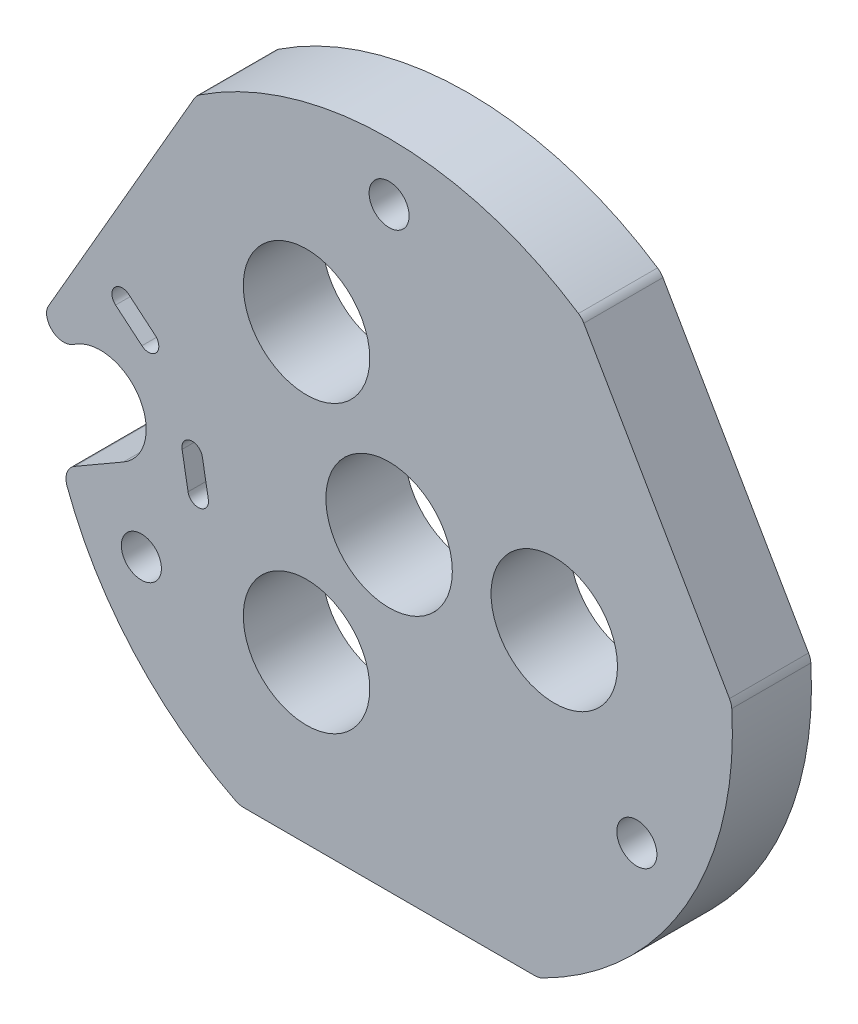
ISO-10303-21;
HEADER;
FILE_DESCRIPTION(('STEP AP214'),'2;1');
FILE_NAME('part.step','',(''),(''),'','','');
FILE_SCHEMA(('AUTOMOTIVE_DESIGN { 1 0 10303 214 1 1 1 1 }'));
ENDSEC;
DATA;
#1=APPLICATION_CONTEXT('core data for automotive mechanical design processes');
#2=APPLICATION_PROTOCOL_DEFINITION('international standard','automotive_design',2000,#1);
#3=PRODUCT_CONTEXT('',#1,'mechanical');
#4=PRODUCT('Part','Part','',(#3));
#5=PRODUCT_RELATED_PRODUCT_CATEGORY('part','',(#4));
#6=PRODUCT_DEFINITION_FORMATION('','',#4);
#7=PRODUCT_DEFINITION_CONTEXT('part definition',#1,'design');
#8=PRODUCT_DEFINITION('design','',#6,#7);
#9=PRODUCT_DEFINITION_SHAPE('','',#8);
#10=(LENGTH_UNIT() NAMED_UNIT(*) SI_UNIT(.MILLI.,.METRE.));
#11=(NAMED_UNIT(*) PLANE_ANGLE_UNIT() SI_UNIT($,.RADIAN.));
#12=(NAMED_UNIT(*) SI_UNIT($,.STERADIAN.) SOLID_ANGLE_UNIT());
#13=UNCERTAINTY_MEASURE_WITH_UNIT(LENGTH_MEASURE(1.E-05),#10,'distance_accuracy_value','');
#14=(GEOMETRIC_REPRESENTATION_CONTEXT(3) GLOBAL_UNCERTAINTY_ASSIGNED_CONTEXT((#13)) GLOBAL_UNIT_ASSIGNED_CONTEXT((#10,
#11,#12)) REPRESENTATION_CONTEXT('',''));
#15=CARTESIAN_POINT('',(0.,0.,0.));
#16=DIRECTION('',(0.,0.,1.));
#17=DIRECTION('',(1.,0.,0.));
#18=AXIS2_PLACEMENT_3D('',#15,#16,#17);
#19=CARTESIAN_POINT('',(13.7481980825256,36.7552666252305,6.91));
#20=DIRECTION('',(0.,0.,1.));
#21=DIRECTION('',(1.,0.,0.));
#22=AXIS2_PLACEMENT_3D('',#19,#20,#21);
#23=PLANE('',#22);
#24=DIRECTION('',(-0.173648177663373,0.984807753012835,0.));
#25=VECTOR('',#24,1.);
#26=CARTESIAN_POINT('',(24.6892351010403,41.4010013884279,6.91));
#27=LINE('',#26,#25);
#28=CARTESIAN_POINT('',(24.6892351010403,41.4010013884279,6.91));
#29=VERTEX_POINT('',#28);
#30=CARTESIAN_POINT('',(24.1682905680395,44.3554246475268,6.91));
#31=VERTEX_POINT('',#30);
#32=EDGE_CURVE('E238',#29,#31,#27,.T.);
#33=ORIENTED_EDGE('',*,*,#32,.F.);
#34=CARTESIAN_POINT('',(23.8029081233297,41.2447180285274,6.91));
#35=DIRECTION('',(0.,0.,1.));
#36=DIRECTION('',(1.,0.,0.));
#37=AXIS2_PLACEMENT_3D('',#34,#35,#36);
#38=CIRCLE('',#37,0.899999999999639);
#39=CARTESIAN_POINT('',(22.9165811456191,41.0884346686269,6.91));
#40=VERTEX_POINT('',#39);
#41=EDGE_CURVE('E236',#40,#29,#38,.T.);
#42=ORIENTED_EDGE('',*,*,#41,.F.);
#43=DIRECTION('',(0.173648177663518,-0.98480775301281,0.));
#44=VECTOR('',#43,1.);
#45=CARTESIAN_POINT('',(22.3956366126177,44.0428579277268,6.91));
#46=LINE('',#45,#44);
#47=CARTESIAN_POINT('',(22.3956366126177,44.0428579277268,6.91));
#48=VERTEX_POINT('',#47);
#49=EDGE_CURVE('E244',#48,#40,#46,.T.);
#50=ORIENTED_EDGE('',*,*,#49,.F.);
#51=CARTESIAN_POINT('',(23.2819635903286,44.199141287627,6.91));
#52=DIRECTION('',(0.,0.,1.));
#53=DIRECTION('',(1.,0.,0.));
#54=AXIS2_PLACEMENT_3D('',#51,#52,#53);
#55=CIRCLE('',#54,0.89999999999986);
#56=EDGE_CURVE('E241',#31,#48,#55,.T.);
#57=ORIENTED_EDGE('',*,*,#56,.F.);
#58=EDGE_LOOP('',(#33,#42,#50,#57));
#59=FACE_BOUND('',#58,.T.);
#60=CARTESIAN_POINT('',(62.1377695042287,34.1182927377275,6.91));
#61=DIRECTION('',(0.,0.,1.));
#62=DIRECTION('',(1.,0.,0.));
#63=AXIS2_PLACEMENT_3D('',#60,#61,#62);
#64=CIRCLE('',#63,1.7500000000004);
#65=CARTESIAN_POINT('',(63.8877695042291,34.1182927377275,6.91));
#66=VERTEX_POINT('',#65);
#67=EDGE_CURVE('E273',#66,#66,#64,.T.);
#68=ORIENTED_EDGE('',*,*,#67,.F.);
#69=EDGE_LOOP('',(#68));
#70=FACE_BOUND('',#69,.T.);
#71=CARTESIAN_POINT('',(40.4871344095733,46.6182927377691,6.91));
#72=DIRECTION('',(0.,0.,1.));
#73=DIRECTION('',(1.,0.,0.));
#74=AXIS2_PLACEMENT_3D('',#71,#72,#73);
#75=CIRCLE('',#74,5.52500000005475);
#76=CARTESIAN_POINT('',(46.012134409628,46.6182927377691,6.91));
#77=VERTEX_POINT('',#76);
#78=EDGE_CURVE('E285',#77,#77,#75,.T.);
#79=ORIENTED_EDGE('',*,*,#78,.F.);
#80=EDGE_LOOP('',(#79));
#81=FACE_BOUND('',#80,.T.);
#82=CARTESIAN_POINT('',(54.9208911393291,46.6182927377279,6.91));
#83=DIRECTION('',(0.,0.,1.));
#84=DIRECTION('',(1.,0.,0.));
#85=AXIS2_PLACEMENT_3D('',#82,#83,#84);
#86=CIRCLE('',#85,5.52499999999999);
#87=CARTESIAN_POINT('',(60.4458911393291,46.6182927377279,6.91));
#88=VERTEX_POINT('',#87);
#89=EDGE_CURVE('E297',#88,#88,#86,.T.);
#90=ORIENTED_EDGE('',*,*,#89,.F.);
#91=EDGE_LOOP('',(#90));
#92=FACE_BOUND('',#91,.T.);
#93=CARTESIAN_POINT('',(13.7481980825256,36.7552666252305,6.91));
#94=DIRECTION('',(0.,0.,1.));
#95=DIRECTION('',(1.,0.,0.));
#96=AXIS2_PLACEMENT_3D('',#93,#94,#95);
#97=CIRCLE('',#96,1.49999999998666);
#98=CARTESIAN_POINT('',(12.9981980825337,38.0543047308963,6.91));
#99=VERTEX_POINT('',#98);
#100=CARTESIAN_POINT('',(12.3408856442696,36.236159987737,6.91));
#101=VERTEX_POINT('',#100);
#102=EDGE_CURVE('E309',#99,#101,#97,.T.);
#103=ORIENTED_EDGE('',*,*,#102,.T.);
#104=CARTESIAN_POINT('',(40.4871344095733,46.6182927377691,6.91));
#105=DIRECTION('',(0.,0.,1.));
#106=DIRECTION('',(1.,0.,0.));
#107=AXIS2_PLACEMENT_3D('',#104,#105,#106);
#108=CIRCLE('',#107,29.9999999999608);
#109=CARTESIAN_POINT('',(27.0893217133919,19.7761874746626,6.91));
#110=VERTEX_POINT('',#109);
#111=EDGE_CURVE('E312',#101,#110,#108,.T.);
#112=ORIENTED_EDGE('',*,*,#111,.T.);
#113=CARTESIAN_POINT('',(27.7592123481972,21.1182927378128,6.91));
#114=DIRECTION('',(0.,0.,1.));
#115=DIRECTION('',(1.,0.,0.));
#116=AXIS2_PLACEMENT_3D('',#113,#114,#115);
#117=CIRCLE('',#116,1.49999999999177);
#118=CARTESIAN_POINT('',(27.7592123481996,19.618292737821,6.91));
#119=VERTEX_POINT('',#118);
#120=EDGE_CURVE('E315',#110,#119,#117,.T.);
#121=ORIENTED_EDGE('',*,*,#120,.T.);
#122=DIRECTION('',(1.,0.,0.));
#123=VECTOR('',#122,1.);
#124=CARTESIAN_POINT('',(27.7592123481996,19.618292737821,6.91));
#125=LINE('',#124,#123);
#126=CARTESIAN_POINT('',(53.2150564709992,19.618292737821,6.91));
#127=VERTEX_POINT('',#126);
#128=EDGE_CURVE('E317',#119,#127,#125,.T.);
#129=ORIENTED_EDGE('',*,*,#128,.T.);
#130=CARTESIAN_POINT('',(53.2150564710555,21.1182927378227,6.91));
#131=DIRECTION('',(0.,0.,1.));
#132=DIRECTION('',(1.,0.,0.));
#133=AXIS2_PLACEMENT_3D('',#130,#131,#132);
#134=CIRCLE('',#133,1.50000000000167);
#135=CARTESIAN_POINT('',(53.8849471057767,19.7761874746195,6.91));
#136=VERTEX_POINT('',#135);
#137=EDGE_CURVE('E319',#127,#136,#134,.T.);
#138=ORIENTED_EDGE('',*,*,#137,.T.);
#139=CARTESIAN_POINT('',(40.4871344095733,46.6182927377691,6.91));
#140=DIRECTION('',(0.,0.,1.));
#141=DIRECTION('',(1.,0.,0.));
#142=AXIS2_PLACEMENT_3D('',#139,#140,#141);
#143=CIRCLE('',#142,30.0000000000092);
#144=CARTESIAN_POINT('',(70.431985806616,48.4364992193272,6.91));
#145=VERTEX_POINT('',#144);
#146=EDGE_CURVE('E321',#136,#145,#143,.T.);
#147=ORIENTED_EDGE('',*,*,#146,.T.);
#148=CARTESIAN_POINT('',(68.93474323675,48.3455888952251,6.91));
#149=DIRECTION('',(0.,0.,1.));
#150=DIRECTION('',(1.,0.,0.));
#151=AXIS2_PLACEMENT_3D('',#148,#149,#150);
#152=CIRCLE('',#151,1.50000000001581);
#153=CARTESIAN_POINT('',(70.2337813424296,49.0955888952516,6.91));
#154=VERTEX_POINT('',#153);
#155=EDGE_CURVE('E323',#145,#154,#152,.T.);
#156=ORIENTED_EDGE('',*,*,#155,.T.);
#157=DIRECTION('',(-0.5,0.866025403784439,0.));
#158=VECTOR('',#157,1.);
#159=CARTESIAN_POINT('',(70.2337813424296,49.0955888952516,6.91));
#160=LINE('',#159,#158);
#161=CARTESIAN_POINT('',(57.5058592810823,71.1409965802819,6.91));
#162=VERTEX_POINT('',#161);
#163=EDGE_CURVE('E325',#154,#162,#160,.T.);
#164=ORIENTED_EDGE('',*,*,#163,.T.);
#165=CARTESIAN_POINT('',(56.2068211753933,70.3909965802341,6.91));
#166=DIRECTION('',(0.,0.,1.));
#167=DIRECTION('',(1.,0.,0.));
#168=AXIS2_PLACEMENT_3D('',#165,#166,#167);
#169=CIRCLE('',#168,1.50000000003459);
#170=CARTESIAN_POINT('',(57.0341731104273,71.642191519362,6.91));
#171=VERTEX_POINT('',#170);
#172=EDGE_CURVE('E327',#162,#171,#169,.T.);
#173=ORIENTED_EDGE('',*,*,#172,.T.);
#174=CARTESIAN_POINT('',(40.4871344095733,46.6182927377691,6.91));
#175=DIRECTION('',(0.,0.,1.));
#176=DIRECTION('',(1.,0.,0.));
#177=AXIS2_PLACEMENT_3D('',#174,#175,#176);
#178=CIRCLE('',#177,29.9999999999828);
#179=CARTESIAN_POINT('',(23.9400957087096,71.6421915193557,6.91));
#180=VERTEX_POINT('',#179);
#181=EDGE_CURVE('E329',#171,#180,#178,.T.);
#182=ORIENTED_EDGE('',*,*,#181,.T.);
#183=CARTESIAN_POINT('',(24.7674476438022,70.3909965803399,6.91));
#184=DIRECTION('',(0.,0.,1.));
#185=DIRECTION('',(1.,0.,0.));
#186=AXIS2_PLACEMENT_3D('',#183,#184,#185);
#187=CIRCLE('',#186,1.49999999997337);
#188=CARTESIAN_POINT('',(23.4684095381059,71.1409965802527,6.91));
#189=VERTEX_POINT('',#188);
#190=EDGE_CURVE('E331',#180,#189,#187,.T.);
#191=ORIENTED_EDGE('',*,*,#190,.T.);
#192=DIRECTION('',(-0.5,-0.866025403784439,0.));
#193=VECTOR('',#192,1.);
#194=CARTESIAN_POINT('',(23.4684095381059,71.1409965802527,6.91));
#195=LINE('',#194,#193);
#196=CARTESIAN_POINT('',(10.7322584968511,49.081335883928,6.91));
#197=VERTEX_POINT('',#196);
#198=EDGE_CURVE('E333',#189,#197,#195,.T.);
#199=ORIENTED_EDGE('',*,*,#198,.T.);
#200=CARTESIAN_POINT('',(12.031296602527,48.3313358839265,6.91));
#201=DIRECTION('',(0.,0.,1.));
#202=DIRECTION('',(1.,0.,0.));
#203=AXIS2_PLACEMENT_3D('',#200,#201,#202);
#204=CIRCLE('',#203,1.50000000000009);
#205=CARTESIAN_POINT('',(10.550877954664,48.5729153264709,6.91));
#206=VERTEX_POINT('',#205);
#207=EDGE_CURVE('E335',#197,#206,#204,.T.);
#208=ORIENTED_EDGE('',*,*,#207,.T.);
#209=CARTESIAN_POINT('',(12.0476907774209,48.4751841970356,6.91));
#210=DIRECTION('',(0.,0.,1.));
#211=DIRECTION('',(1.,0.,0.));
#212=AXIS2_PLACEMENT_3D('',#209,#210,#211);
#213=CIRCLE('',#212,1.50000000001005);
#214=CARTESIAN_POINT('',(12.7976907774277,47.1761460913513,6.91));
#215=VERTEX_POINT('',#214);
#216=EDGE_CURVE('E337',#206,#215,#213,.T.);
#217=ORIENTED_EDGE('',*,*,#216,.T.);
#218=DIRECTION('',(0.86602540378444,0.499999999999998,0.));
#219=VECTOR('',#218,1.);
#220=CARTESIAN_POINT('',(12.7976907774277,47.1761460913513,6.91));
#221=LINE('',#220,#219);
#222=CARTESIAN_POINT('',(13.2606834363141,47.4434550275921,6.91));
#223=VERTEX_POINT('',#222);
#224=EDGE_CURVE('E339',#215,#223,#221,.T.);
#225=ORIENTED_EDGE('',*,*,#224,.T.);
#226=CARTESIAN_POINT('',(15.2606834363134,43.9793534124548,6.91));
#227=DIRECTION('',(0.,0.,-1.));
#228=DIRECTION('',(1.,0.,0.));
#229=AXIS2_PLACEMENT_3D('',#226,#227,#228);
#230=CIRCLE('',#229,3.99999999999927);
#231=CARTESIAN_POINT('',(17.2606834363124,40.5152517973173,6.91));
#232=VERTEX_POINT('',#231);
#233=EDGE_CURVE('E341',#223,#232,#230,.T.);
#234=ORIENTED_EDGE('',*,*,#233,.T.);
#235=DIRECTION('',(-0.866025403784439,-0.5,0.));
#236=VECTOR('',#235,1.);
#237=CARTESIAN_POINT('',(17.2606834363124,40.5152517973173,6.91));
#238=LINE('',#237,#236);
#239=EDGE_CURVE('E343',#232,#99,#238,.T.);
#240=ORIENTED_EDGE('',*,*,#239,.T.);
#241=EDGE_LOOP('',(#103,#112,#121,#129,#138,#147,#156,#164,#173,#182,#191,#199,#208,#217,#225,
#234,#240));
#242=FACE_BOUND('',#241,.T.);
#243=CARTESIAN_POINT('',(33.2702560447294,34.1182927377288,6.91));
#244=DIRECTION('',(0.,0.,1.));
#245=DIRECTION('',(1.,0.,0.));
#246=AXIS2_PLACEMENT_3D('',#243,#244,#245);
#247=CIRCLE('',#246,5.52499999999935);
#248=CARTESIAN_POINT('',(38.7952560447287,34.1182927377288,6.91));
#249=VERTEX_POINT('',#248);
#250=EDGE_CURVE('E303',#249,#249,#247,.T.);
#251=ORIENTED_EDGE('',*,*,#250,.F.);
#252=EDGE_LOOP('',(#251));
#253=FACE_BOUND('',#252,.T.);
#254=CARTESIAN_POINT('',(33.2702560447282,59.1182927377278,6.91));
#255=DIRECTION('',(0.,0.,1.));
#256=DIRECTION('',(1.,0.,0.));
#257=AXIS2_PLACEMENT_3D('',#254,#255,#256);
#258=CIRCLE('',#257,5.52500000000052);
#259=CARTESIAN_POINT('',(38.7952560447287,59.1182927377278,6.91));
#260=VERTEX_POINT('',#259);
#261=EDGE_CURVE('E291',#260,#260,#258,.T.);
#262=ORIENTED_EDGE('',*,*,#261,.F.);
#263=EDGE_LOOP('',(#262));
#264=FACE_BOUND('',#263,.T.);
#265=CARTESIAN_POINT('',(18.8364993150286,34.1182927377272,6.91));
#266=DIRECTION('',(0.,0.,1.));
#267=DIRECTION('',(1.,0.,0.));
#268=AXIS2_PLACEMENT_3D('',#265,#266,#267);
#269=CIRCLE('',#268,1.75000000000018);
#270=CARTESIAN_POINT('',(20.5864993150288,34.1182927377272,6.91));
#271=VERTEX_POINT('',#270);
#272=EDGE_CURVE('E279',#271,#271,#269,.T.);
#273=ORIENTED_EDGE('',*,*,#272,.F.);
#274=EDGE_LOOP('',(#273));
#275=FACE_BOUND('',#274,.T.);
#276=CARTESIAN_POINT('',(40.4871344096287,71.6182927377274,6.91));
#277=DIRECTION('',(0.,0.,1.));
#278=DIRECTION('',(1.,0.,0.));
#279=AXIS2_PLACEMENT_3D('',#276,#277,#278);
#280=CIRCLE('',#279,1.74999999999961);
#281=CARTESIAN_POINT('',(42.2371344096283,71.6182927377274,6.91));
#282=VERTEX_POINT('',#281);
#283=EDGE_CURVE('E267',#282,#282,#280,.T.);
#284=ORIENTED_EDGE('',*,*,#283,.F.);
#285=EDGE_LOOP('',(#284));
#286=FACE_BOUND('',#285,.T.);
#287=DIRECTION('',(-0.766044443124658,0.64278760967977,0.));
#288=VECTOR('',#287,1.);
#289=CARTESIAN_POINT('',(20.040174245348,51.5055318580342,6.91));
#290=LINE('',#289,#288);
#291=CARTESIAN_POINT('',(20.040174245348,51.5055318580342,6.91));
#292=VERTEX_POINT('',#291);
#293=CARTESIAN_POINT('',(17.7420409160288,53.4338946870276,6.91));
#294=VERTEX_POINT('',#293);
#295=EDGE_CURVE('E208',#292,#294,#290,.T.);
#296=ORIENTED_EDGE('',*,*,#295,.F.);
#297=CARTESIAN_POINT('',(19.4616653966295,50.8160918592269,6.91));
#298=DIRECTION('',(0.,0.,1.));
#299=DIRECTION('',(1.,0.,0.));
#300=AXIS2_PLACEMENT_3D('',#297,#298,#299);
#301=CIRCLE('',#300,0.90000000000055);
#302=CARTESIAN_POINT('',(18.883156547911,50.1266518604197,6.91));
#303=VERTEX_POINT('',#302);
#304=EDGE_CURVE('E200',#303,#292,#301,.T.);
#305=ORIENTED_EDGE('',*,*,#304,.F.);
#306=DIRECTION('',(0.766044443130981,-0.642787609672235,0.));
#307=VECTOR('',#306,1.);
#308=CARTESIAN_POINT('',(16.5850232185286,52.0550146894275,6.91));
#309=LINE('',#308,#307);
#310=CARTESIAN_POINT('',(16.5850232185286,52.0550146894275,6.91));
#311=VERTEX_POINT('',#310);
#312=EDGE_CURVE('E222',#311,#303,#309,.T.);
#313=ORIENTED_EDGE('',*,*,#312,.F.);
#314=CARTESIAN_POINT('',(17.1635320672785,52.7444546882277,6.91));
#315=DIRECTION('',(0.,0.,1.));
#316=DIRECTION('',(1.,0.,0.));
#317=AXIS2_PLACEMENT_3D('',#314,#315,#316);
#318=CIRCLE('',#317,0.900000000015303);
#319=EDGE_CURVE('E220',#294,#311,#318,.T.);
#320=ORIENTED_EDGE('',*,*,#319,.F.);
#321=EDGE_LOOP('',(#296,#305,#313,#320));
#322=FACE_BOUND('',#321,.T.);
#323=ADVANCED_FACE('F33',(#59,#70,#81,#92,#242,#253,#264,#275,#286,#322),#23,.T.);
#324=CARTESIAN_POINT('',(13.7481980825256,36.7552666252305,0.));
#325=DIRECTION('',(0.,0.,1.));
#326=DIRECTION('',(1.,0.,0.));
#327=AXIS2_PLACEMENT_3D('',#324,#325,#326);
#328=PLANE('',#327);
#329=CARTESIAN_POINT('',(23.8029081233297,41.2447180285274,0.));
#330=DIRECTION('',(0.,0.,1.));
#331=DIRECTION('',(1.,0.,0.));
#332=AXIS2_PLACEMENT_3D('',#329,#330,#331);
#333=CIRCLE('',#332,0.899999999999639);
#334=CARTESIAN_POINT('',(22.9165811456191,41.0884346686269,0.));
#335=VERTEX_POINT('',#334);
#336=CARTESIAN_POINT('',(24.6892351010403,41.4010013884279,0.));
#337=VERTEX_POINT('',#336);
#338=EDGE_CURVE('E216',#335,#337,#333,.T.);
#339=ORIENTED_EDGE('',*,*,#338,.T.);
#340=DIRECTION('',(-0.173648177663373,0.984807753012835,0.));
#341=VECTOR('',#340,1.);
#342=CARTESIAN_POINT('',(24.6892351010403,41.4010013884279,0.));
#343=LINE('',#342,#341);
#344=CARTESIAN_POINT('',(24.1682905680395,44.3554246475268,0.));
#345=VERTEX_POINT('',#344);
#346=EDGE_CURVE('E249',#337,#345,#343,.T.);
#347=ORIENTED_EDGE('',*,*,#346,.T.);
#348=CARTESIAN_POINT('',(23.2819635903286,44.199141287627,0.));
#349=DIRECTION('',(0.,0.,1.));
#350=DIRECTION('',(1.,0.,0.));
#351=AXIS2_PLACEMENT_3D('',#348,#349,#350);
#352=CIRCLE('',#351,0.89999999999986);
#353=CARTESIAN_POINT('',(22.3956366126177,44.0428579277268,0.));
#354=VERTEX_POINT('',#353);
#355=EDGE_CURVE('E252',#345,#354,#352,.T.);
#356=ORIENTED_EDGE('',*,*,#355,.T.);
#357=DIRECTION('',(0.173648177663518,-0.98480775301281,0.));
#358=VECTOR('',#357,1.);
#359=CARTESIAN_POINT('',(22.3956366126177,44.0428579277268,0.));
#360=LINE('',#359,#358);
#361=EDGE_CURVE('E239',#354,#335,#360,.T.);
#362=ORIENTED_EDGE('',*,*,#361,.T.);
#363=EDGE_LOOP('',(#339,#347,#356,#362));
#364=FACE_BOUND('',#363,.T.);
#365=CARTESIAN_POINT('',(62.1377695042287,34.1182927377275,0.));
#366=DIRECTION('',(0.,0.,1.));
#367=DIRECTION('',(1.,0.,0.));
#368=AXIS2_PLACEMENT_3D('',#365,#366,#367);
#369=CIRCLE('',#368,1.7500000000004);
#370=CARTESIAN_POINT('',(63.8877695042291,34.1182927377275,0.));
#371=VERTEX_POINT('',#370);
#372=EDGE_CURVE('E270',#371,#371,#369,.T.);
#373=ORIENTED_EDGE('',*,*,#372,.T.);
#374=EDGE_LOOP('',(#373));
#375=FACE_BOUND('',#374,.T.);
#376=CARTESIAN_POINT('',(40.4871344095733,46.6182927377691,0.));
#377=DIRECTION('',(0.,0.,1.));
#378=DIRECTION('',(1.,0.,0.));
#379=AXIS2_PLACEMENT_3D('',#376,#377,#378);
#380=CIRCLE('',#379,5.52500000005475);
#381=CARTESIAN_POINT('',(46.012134409628,46.6182927377691,0.));
#382=VERTEX_POINT('',#381);
#383=EDGE_CURVE('E282',#382,#382,#380,.T.);
#384=ORIENTED_EDGE('',*,*,#383,.T.);
#385=EDGE_LOOP('',(#384));
#386=FACE_BOUND('',#385,.T.);
#387=CARTESIAN_POINT('',(54.9208911393291,46.6182927377279,0.));
#388=DIRECTION('',(0.,0.,1.));
#389=DIRECTION('',(1.,0.,0.));
#390=AXIS2_PLACEMENT_3D('',#387,#388,#389);
#391=CIRCLE('',#390,5.52499999999999);
#392=CARTESIAN_POINT('',(60.4458911393291,46.6182927377279,0.));
#393=VERTEX_POINT('',#392);
#394=EDGE_CURVE('E294',#393,#393,#391,.T.);
#395=ORIENTED_EDGE('',*,*,#394,.T.);
#396=EDGE_LOOP('',(#395));
#397=FACE_BOUND('',#396,.T.);
#398=CARTESIAN_POINT('',(13.7481980825256,36.7552666252305,0.));
#399=DIRECTION('',(0.,0.,1.));
#400=DIRECTION('',(1.,0.,0.));
#401=AXIS2_PLACEMENT_3D('',#398,#399,#400);
#402=CIRCLE('',#401,1.49999999998666);
#403=CARTESIAN_POINT('',(12.9981980825337,38.0543047308963,0.));
#404=VERTEX_POINT('',#403);
#405=CARTESIAN_POINT('',(12.3408856442696,36.236159987737,0.));
#406=VERTEX_POINT('',#405);
#407=EDGE_CURVE('E306',#404,#406,#402,.T.);
#408=ORIENTED_EDGE('',*,*,#407,.F.);
#409=DIRECTION('',(-0.866025403784439,-0.5,0.));
#410=VECTOR('',#409,1.);
#411=CARTESIAN_POINT('',(17.2606834363124,40.5152517973173,0.));
#412=LINE('',#411,#410);
#413=CARTESIAN_POINT('',(17.2606834363124,40.5152517973173,0.));
#414=VERTEX_POINT('',#413);
#415=EDGE_CURVE('E313',#414,#404,#412,.T.);
#416=ORIENTED_EDGE('',*,*,#415,.F.);
#417=CARTESIAN_POINT('',(15.2606834363134,43.9793534124548,0.));
#418=DIRECTION('',(0.,0.,-1.));
#419=DIRECTION('',(1.,0.,0.));
#420=AXIS2_PLACEMENT_3D('',#417,#418,#419);
#421=CIRCLE('',#420,3.99999999999927);
#422=CARTESIAN_POINT('',(13.2606834363141,47.4434550275921,0.));
#423=VERTEX_POINT('',#422);
#424=EDGE_CURVE('E376',#423,#414,#421,.T.);
#425=ORIENTED_EDGE('',*,*,#424,.F.);
#426=DIRECTION('',(0.86602540378444,0.499999999999998,0.));
#427=VECTOR('',#426,1.);
#428=CARTESIAN_POINT('',(12.7976907774277,47.1761460913513,0.));
#429=LINE('',#428,#427);
#430=CARTESIAN_POINT('',(12.7976907774277,47.1761460913513,0.));
#431=VERTEX_POINT('',#430);
#432=EDGE_CURVE('E374',#431,#423,#429,.T.);
#433=ORIENTED_EDGE('',*,*,#432,.F.);
#434=CARTESIAN_POINT('',(12.0476907774209,48.4751841970356,0.));
#435=DIRECTION('',(0.,0.,1.));
#436=DIRECTION('',(1.,0.,0.));
#437=AXIS2_PLACEMENT_3D('',#434,#435,#436);
#438=CIRCLE('',#437,1.50000000001005);
#439=CARTESIAN_POINT('',(10.550877954664,48.5729153264709,0.));
#440=VERTEX_POINT('',#439);
#441=EDGE_CURVE('E372',#440,#431,#438,.T.);
#442=ORIENTED_EDGE('',*,*,#441,.F.);
#443=CARTESIAN_POINT('',(12.031296602527,48.3313358839265,0.));
#444=DIRECTION('',(0.,0.,1.));
#445=DIRECTION('',(1.,0.,0.));
#446=AXIS2_PLACEMENT_3D('',#443,#444,#445);
#447=CIRCLE('',#446,1.50000000000009);
#448=CARTESIAN_POINT('',(10.7322584968511,49.081335883928,0.));
#449=VERTEX_POINT('',#448);
#450=EDGE_CURVE('E370',#449,#440,#447,.T.);
#451=ORIENTED_EDGE('',*,*,#450,.F.);
#452=DIRECTION('',(-0.5,-0.866025403784439,0.));
#453=VECTOR('',#452,1.);
#454=CARTESIAN_POINT('',(23.4684095381059,71.1409965802527,0.));
#455=LINE('',#454,#453);
#456=CARTESIAN_POINT('',(23.4684095381059,71.1409965802527,0.));
#457=VERTEX_POINT('',#456);
#458=EDGE_CURVE('E368',#457,#449,#455,.T.);
#459=ORIENTED_EDGE('',*,*,#458,.F.);
#460=CARTESIAN_POINT('',(24.7674476438022,70.3909965803399,0.));
#461=DIRECTION('',(0.,0.,1.));
#462=DIRECTION('',(1.,0.,0.));
#463=AXIS2_PLACEMENT_3D('',#460,#461,#462);
#464=CIRCLE('',#463,1.49999999997337);
#465=CARTESIAN_POINT('',(23.9400957087096,71.6421915193557,0.));
#466=VERTEX_POINT('',#465);
#467=EDGE_CURVE('E366',#466,#457,#464,.T.);
#468=ORIENTED_EDGE('',*,*,#467,.F.);
#469=CARTESIAN_POINT('',(40.4871344095733,46.6182927377691,0.));
#470=DIRECTION('',(0.,0.,1.));
#471=DIRECTION('',(1.,0.,0.));
#472=AXIS2_PLACEMENT_3D('',#469,#470,#471);
#473=CIRCLE('',#472,29.9999999999828);
#474=CARTESIAN_POINT('',(57.0341731104273,71.642191519362,0.));
#475=VERTEX_POINT('',#474);
#476=EDGE_CURVE('E364',#475,#466,#473,.T.);
#477=ORIENTED_EDGE('',*,*,#476,.F.);
#478=CARTESIAN_POINT('',(56.2068211753933,70.3909965802341,0.));
#479=DIRECTION('',(0.,0.,1.));
#480=DIRECTION('',(1.,0.,0.));
#481=AXIS2_PLACEMENT_3D('',#478,#479,#480);
#482=CIRCLE('',#481,1.50000000003459);
#483=CARTESIAN_POINT('',(57.5058592810823,71.1409965802819,0.));
#484=VERTEX_POINT('',#483);
#485=EDGE_CURVE('E362',#484,#475,#482,.T.);
#486=ORIENTED_EDGE('',*,*,#485,.F.);
#487=DIRECTION('',(-0.5,0.866025403784439,0.));
#488=VECTOR('',#487,1.);
#489=CARTESIAN_POINT('',(70.2337813424296,49.0955888952516,0.));
#490=LINE('',#489,#488);
#491=CARTESIAN_POINT('',(70.2337813424296,49.0955888952516,0.));
#492=VERTEX_POINT('',#491);
#493=EDGE_CURVE('E360',#492,#484,#490,.T.);
#494=ORIENTED_EDGE('',*,*,#493,.F.);
#495=CARTESIAN_POINT('',(68.93474323675,48.3455888952251,0.));
#496=DIRECTION('',(0.,0.,1.));
#497=DIRECTION('',(1.,0.,0.));
#498=AXIS2_PLACEMENT_3D('',#495,#496,#497);
#499=CIRCLE('',#498,1.50000000001581);
#500=CARTESIAN_POINT('',(70.431985806616,48.4364992193272,0.));
#501=VERTEX_POINT('',#500);
#502=EDGE_CURVE('E358',#501,#492,#499,.T.);
#503=ORIENTED_EDGE('',*,*,#502,.F.);
#504=CARTESIAN_POINT('',(40.4871344095733,46.6182927377691,0.));
#505=DIRECTION('',(0.,0.,1.));
#506=DIRECTION('',(1.,0.,0.));
#507=AXIS2_PLACEMENT_3D('',#504,#505,#506);
#508=CIRCLE('',#507,30.0000000000092);
#509=CARTESIAN_POINT('',(53.8849471057767,19.7761874746195,0.));
#510=VERTEX_POINT('',#509);
#511=EDGE_CURVE('E356',#510,#501,#508,.T.);
#512=ORIENTED_EDGE('',*,*,#511,.F.);
#513=CARTESIAN_POINT('',(53.2150564710555,21.1182927378227,0.));
#514=DIRECTION('',(0.,0.,1.));
#515=DIRECTION('',(1.,0.,0.));
#516=AXIS2_PLACEMENT_3D('',#513,#514,#515);
#517=CIRCLE('',#516,1.50000000000167);
#518=CARTESIAN_POINT('',(53.2150564709992,19.618292737821,0.));
#519=VERTEX_POINT('',#518);
#520=EDGE_CURVE('E354',#519,#510,#517,.T.);
#521=ORIENTED_EDGE('',*,*,#520,.F.);
#522=DIRECTION('',(1.,0.,0.));
#523=VECTOR('',#522,1.);
#524=CARTESIAN_POINT('',(27.7592123481996,19.618292737821,0.));
#525=LINE('',#524,#523);
#526=CARTESIAN_POINT('',(27.7592123481996,19.618292737821,0.));
#527=VERTEX_POINT('',#526);
#528=EDGE_CURVE('E352',#527,#519,#525,.T.);
#529=ORIENTED_EDGE('',*,*,#528,.F.);
#530=CARTESIAN_POINT('',(27.7592123481972,21.1182927378128,0.));
#531=DIRECTION('',(0.,0.,1.));
#532=DIRECTION('',(1.,0.,0.));
#533=AXIS2_PLACEMENT_3D('',#530,#531,#532);
#534=CIRCLE('',#533,1.49999999999177);
#535=CARTESIAN_POINT('',(27.0893217133919,19.7761874746626,0.));
#536=VERTEX_POINT('',#535);
#537=EDGE_CURVE('E350',#536,#527,#534,.T.);
#538=ORIENTED_EDGE('',*,*,#537,.F.);
#539=CARTESIAN_POINT('',(40.4871344095733,46.6182927377691,0.));
#540=DIRECTION('',(0.,0.,1.));
#541=DIRECTION('',(1.,0.,0.));
#542=AXIS2_PLACEMENT_3D('',#539,#540,#541);
#543=CIRCLE('',#542,29.9999999999608);
#544=EDGE_CURVE('E348',#406,#536,#543,.T.);
#545=ORIENTED_EDGE('',*,*,#544,.F.);
#546=EDGE_LOOP('',(#408,#416,#425,#433,#442,#451,#459,#468,#477,#486,#494,#503,#512,#521,#529,
#538,#545));
#547=FACE_BOUND('',#546,.T.);
#548=CARTESIAN_POINT('',(33.2702560447294,34.1182927377288,0.));
#549=DIRECTION('',(0.,0.,1.));
#550=DIRECTION('',(1.,0.,0.));
#551=AXIS2_PLACEMENT_3D('',#548,#549,#550);
#552=CIRCLE('',#551,5.52499999999935);
#553=CARTESIAN_POINT('',(38.7952560447287,34.1182927377288,0.));
#554=VERTEX_POINT('',#553);
#555=EDGE_CURVE('E300',#554,#554,#552,.T.);
#556=ORIENTED_EDGE('',*,*,#555,.T.);
#557=EDGE_LOOP('',(#556));
#558=FACE_BOUND('',#557,.T.);
#559=CARTESIAN_POINT('',(33.2702560447282,59.1182927377278,0.));
#560=DIRECTION('',(0.,0.,1.));
#561=DIRECTION('',(1.,0.,0.));
#562=AXIS2_PLACEMENT_3D('',#559,#560,#561);
#563=CIRCLE('',#562,5.52500000000052);
#564=CARTESIAN_POINT('',(38.7952560447287,59.1182927377278,0.));
#565=VERTEX_POINT('',#564);
#566=EDGE_CURVE('E288',#565,#565,#563,.T.);
#567=ORIENTED_EDGE('',*,*,#566,.T.);
#568=EDGE_LOOP('',(#567));
#569=FACE_BOUND('',#568,.T.);
#570=CARTESIAN_POINT('',(18.8364993150286,34.1182927377272,0.));
#571=DIRECTION('',(0.,0.,1.));
#572=DIRECTION('',(1.,0.,0.));
#573=AXIS2_PLACEMENT_3D('',#570,#571,#572);
#574=CIRCLE('',#573,1.75000000000018);
#575=CARTESIAN_POINT('',(20.5864993150288,34.1182927377272,0.));
#576=VERTEX_POINT('',#575);
#577=EDGE_CURVE('E276',#576,#576,#574,.T.);
#578=ORIENTED_EDGE('',*,*,#577,.T.);
#579=EDGE_LOOP('',(#578));
#580=FACE_BOUND('',#579,.T.);
#581=CARTESIAN_POINT('',(40.4871344096287,71.6182927377274,0.));
#582=DIRECTION('',(0.,0.,1.));
#583=DIRECTION('',(1.,0.,0.));
#584=AXIS2_PLACEMENT_3D('',#581,#582,#583);
#585=CIRCLE('',#584,1.74999999999961);
#586=CARTESIAN_POINT('',(42.2371344096283,71.6182927377274,0.));
#587=VERTEX_POINT('',#586);
#588=EDGE_CURVE('E266',#587,#587,#585,.T.);
#589=ORIENTED_EDGE('',*,*,#588,.T.);
#590=EDGE_LOOP('',(#589));
#591=FACE_BOUND('',#590,.T.);
#592=CARTESIAN_POINT('',(19.4616653966295,50.8160918592269,0.));
#593=DIRECTION('',(0.,0.,1.));
#594=DIRECTION('',(1.,0.,0.));
#595=AXIS2_PLACEMENT_3D('',#592,#593,#594);
#596=CIRCLE('',#595,0.90000000000055);
#597=CARTESIAN_POINT('',(18.883156547911,50.1266518604197,0.));
#598=VERTEX_POINT('',#597);
#599=CARTESIAN_POINT('',(20.040174245348,51.5055318580342,0.));
#600=VERTEX_POINT('',#599);
#601=EDGE_CURVE('E56',#598,#600,#596,.T.);
#602=ORIENTED_EDGE('',*,*,#601,.T.);
#603=DIRECTION('',(-0.766044443124658,0.64278760967977,0.));
#604=VECTOR('',#603,1.);
#605=CARTESIAN_POINT('',(20.040174245348,51.5055318580342,0.));
#606=LINE('',#605,#604);
#607=CARTESIAN_POINT('',(17.7420409160288,53.4338946870276,0.));
#608=VERTEX_POINT('',#607);
#609=EDGE_CURVE('E215',#600,#608,#606,.T.);
#610=ORIENTED_EDGE('',*,*,#609,.T.);
#611=CARTESIAN_POINT('',(17.1635320672785,52.7444546882277,0.));
#612=DIRECTION('',(0.,0.,1.));
#613=DIRECTION('',(1.,0.,0.));
#614=AXIS2_PLACEMENT_3D('',#611,#612,#613);
#615=CIRCLE('',#614,0.900000000015303);
#616=CARTESIAN_POINT('',(16.5850232185286,52.0550146894275,0.));
#617=VERTEX_POINT('',#616);
#618=EDGE_CURVE('E228',#608,#617,#615,.T.);
#619=ORIENTED_EDGE('',*,*,#618,.T.);
#620=DIRECTION('',(0.766044443130981,-0.642787609672235,0.));
#621=VECTOR('',#620,1.);
#622=CARTESIAN_POINT('',(16.5850232185286,52.0550146894275,0.));
#623=LINE('',#622,#621);
#624=EDGE_CURVE('E209',#617,#598,#623,.T.);
#625=ORIENTED_EDGE('',*,*,#624,.T.);
#626=EDGE_LOOP('',(#602,#610,#619,#625));
#627=FACE_BOUND('',#626,.T.);
#628=ADVANCED_FACE('F433',(#364,#375,#386,#397,#547,#558,#569,#580,#591,#627),#328,.F.);
#629=CARTESIAN_POINT('',(13.7481980825256,36.7552666252305,6.91));
#630=DIRECTION('',(0.,0.,-1.));
#631=DIRECTION('',(-1.,0.,0.));
#632=AXIS2_PLACEMENT_3D('',#629,#630,#631);
#633=CYLINDRICAL_SURFACE('',#632,1.49999999998666);
#634=ORIENTED_EDGE('',*,*,#407,.T.);
#635=DIRECTION('',(0.,0.,-1.));
#636=VECTOR('',#635,1.);
#637=CARTESIAN_POINT('',(12.3408856442696,36.236159987737,6.91));
#638=LINE('',#637,#636);
#639=EDGE_CURVE('E11',#101,#406,#638,.T.);
#640=ORIENTED_EDGE('',*,*,#639,.F.);
#641=ORIENTED_EDGE('',*,*,#102,.F.);
#642=DIRECTION('',(0.,0.,-1.));
#643=VECTOR('',#642,1.);
#644=CARTESIAN_POINT('',(12.9981980825337,38.0543047308963,6.91));
#645=LINE('',#644,#643);
#646=EDGE_CURVE('E345',#99,#404,#645,.T.);
#647=ORIENTED_EDGE('',*,*,#646,.T.);
#648=EDGE_LOOP('',(#634,#640,#641,#647));
#649=FACE_BOUND('',#648,.T.);
#650=ADVANCED_FACE('F35',(#649),#633,.T.);
#651=CARTESIAN_POINT('',(40.4871344095733,46.6182927377691,6.91));
#652=DIRECTION('',(0.,0.,-1.));
#653=DIRECTION('',(-1.,0.,0.));
#654=AXIS2_PLACEMENT_3D('',#651,#652,#653);
#655=CYLINDRICAL_SURFACE('',#654,29.9999999999608);
#656=ORIENTED_EDGE('',*,*,#544,.T.);
#657=DIRECTION('',(0.,0.,-1.));
#658=VECTOR('',#657,1.);
#659=CARTESIAN_POINT('',(27.0893217133919,19.7761874746626,6.91));
#660=LINE('',#659,#658);
#661=EDGE_CURVE('E41',#110,#536,#660,.T.);
#662=ORIENTED_EDGE('',*,*,#661,.F.);
#663=ORIENTED_EDGE('',*,*,#111,.F.);
#664=ORIENTED_EDGE('',*,*,#639,.T.);
#665=EDGE_LOOP('',(#656,#662,#663,#664));
#666=FACE_BOUND('',#665,.T.);
#667=ADVANCED_FACE('F451',(#666),#655,.T.);
#668=CARTESIAN_POINT('',(27.7592123481972,21.1182927378128,6.91));
#669=DIRECTION('',(0.,0.,-1.));
#670=DIRECTION('',(-1.,0.,0.));
#671=AXIS2_PLACEMENT_3D('',#668,#669,#670);
#672=CYLINDRICAL_SURFACE('',#671,1.49999999999177);
#673=ORIENTED_EDGE('',*,*,#537,.T.);
#674=DIRECTION('',(0.,0.,-1.));
#675=VECTOR('',#674,1.);
#676=CARTESIAN_POINT('',(27.7592123481996,19.618292737821,6.91));
#677=LINE('',#676,#675);
#678=EDGE_CURVE('E420',#119,#527,#677,.T.);
#679=ORIENTED_EDGE('',*,*,#678,.F.);
#680=ORIENTED_EDGE('',*,*,#120,.F.);
#681=ORIENTED_EDGE('',*,*,#661,.T.);
#682=EDGE_LOOP('',(#673,#679,#680,#681));
#683=FACE_BOUND('',#682,.T.);
#684=ADVANCED_FACE('F427',(#683),#672,.T.);
#685=CARTESIAN_POINT('',(27.7592123481996,19.618292737821,6.91));
#686=DIRECTION('',(0.,1.,0.));
#687=DIRECTION('',(0.,0.,1.));
#688=AXIS2_PLACEMENT_3D('',#685,#686,#687);
#689=PLANE('',#688);
#690=ORIENTED_EDGE('',*,*,#528,.T.);
#691=DIRECTION('',(0.,0.,-1.));
#692=VECTOR('',#691,1.);
#693=CARTESIAN_POINT('',(53.2150564709992,19.618292737821,6.91));
#694=LINE('',#693,#692);
#695=EDGE_CURVE('E417',#127,#519,#694,.T.);
#696=ORIENTED_EDGE('',*,*,#695,.F.);
#697=ORIENTED_EDGE('',*,*,#128,.F.);
#698=ORIENTED_EDGE('',*,*,#678,.T.);
#699=EDGE_LOOP('',(#690,#696,#697,#698));
#700=FACE_BOUND('',#699,.T.);
#701=ADVANCED_FACE('F439',(#700),#689,.F.);
#702=CARTESIAN_POINT('',(53.2150564710555,21.1182927378227,6.91));
#703=DIRECTION('',(0.,0.,-1.));
#704=DIRECTION('',(-1.,0.,0.));
#705=AXIS2_PLACEMENT_3D('',#702,#703,#704);
#706=CYLINDRICAL_SURFACE('',#705,1.50000000000167);
#707=ORIENTED_EDGE('',*,*,#520,.T.);
#708=DIRECTION('',(0.,0.,-1.));
#709=VECTOR('',#708,1.);
#710=CARTESIAN_POINT('',(53.8849471057767,19.7761874746195,6.91));
#711=LINE('',#710,#709);
#712=EDGE_CURVE('E414',#136,#510,#711,.T.);
#713=ORIENTED_EDGE('',*,*,#712,.F.);
#714=ORIENTED_EDGE('',*,*,#137,.F.);
#715=ORIENTED_EDGE('',*,*,#695,.T.);
#716=EDGE_LOOP('',(#707,#713,#714,#715));
#717=FACE_BOUND('',#716,.T.);
#718=ADVANCED_FACE('F443',(#717),#706,.T.);
#719=CARTESIAN_POINT('',(40.4871344095733,46.6182927377691,6.91));
#720=DIRECTION('',(0.,0.,-1.));
#721=DIRECTION('',(-1.,0.,0.));
#722=AXIS2_PLACEMENT_3D('',#719,#720,#721);
#723=CYLINDRICAL_SURFACE('',#722,30.0000000000092);
#724=ORIENTED_EDGE('',*,*,#511,.T.);
#725=DIRECTION('',(0.,0.,-1.));
#726=VECTOR('',#725,1.);
#727=CARTESIAN_POINT('',(70.431985806616,48.4364992193272,6.91));
#728=LINE('',#727,#726);
#729=EDGE_CURVE('E411',#145,#501,#728,.T.);
#730=ORIENTED_EDGE('',*,*,#729,.F.);
#731=ORIENTED_EDGE('',*,*,#146,.F.);
#732=ORIENTED_EDGE('',*,*,#712,.T.);
#733=EDGE_LOOP('',(#724,#730,#731,#732));
#734=FACE_BOUND('',#733,.T.);
#735=ADVANCED_FACE('F509',(#734),#723,.T.);
#736=CARTESIAN_POINT('',(68.93474323675,48.3455888952251,6.91));
#737=DIRECTION('',(0.,0.,-1.));
#738=DIRECTION('',(-1.,0.,0.));
#739=AXIS2_PLACEMENT_3D('',#736,#737,#738);
#740=CYLINDRICAL_SURFACE('',#739,1.50000000001581);
#741=ORIENTED_EDGE('',*,*,#502,.T.);
#742=DIRECTION('',(0.,0.,-1.));
#743=VECTOR('',#742,1.);
#744=CARTESIAN_POINT('',(70.2337813424296,49.0955888952516,6.91));
#745=LINE('',#744,#743);
#746=EDGE_CURVE('E408',#154,#492,#745,.T.);
#747=ORIENTED_EDGE('',*,*,#746,.F.);
#748=ORIENTED_EDGE('',*,*,#155,.F.);
#749=ORIENTED_EDGE('',*,*,#729,.T.);
#750=EDGE_LOOP('',(#741,#747,#748,#749));
#751=FACE_BOUND('',#750,.T.);
#752=ADVANCED_FACE('F507',(#751),#740,.T.);
#753=CARTESIAN_POINT('',(70.2337813424296,49.0955888952516,6.91));
#754=DIRECTION('',(-0.866025403784439,-0.5,0.));
#755=DIRECTION('',(0.5,-0.866025403784439,0.));
#756=AXIS2_PLACEMENT_3D('',#753,#754,#755);
#757=PLANE('',#756);
#758=ORIENTED_EDGE('',*,*,#493,.T.);
#759=DIRECTION('',(0.,0.,-1.));
#760=VECTOR('',#759,1.);
#761=CARTESIAN_POINT('',(57.5058592810823,71.1409965802819,6.91));
#762=LINE('',#761,#760);
#763=EDGE_CURVE('E405',#162,#484,#762,.T.);
#764=ORIENTED_EDGE('',*,*,#763,.F.);
#765=ORIENTED_EDGE('',*,*,#163,.F.);
#766=ORIENTED_EDGE('',*,*,#746,.T.);
#767=EDGE_LOOP('',(#758,#764,#765,#766));
#768=FACE_BOUND('',#767,.T.);
#769=ADVANCED_FACE('F502',(#768),#757,.F.);
#770=CARTESIAN_POINT('',(56.2068211753933,70.3909965802341,6.91));
#771=DIRECTION('',(0.,0.,-1.));
#772=DIRECTION('',(-1.,0.,0.));
#773=AXIS2_PLACEMENT_3D('',#770,#771,#772);
#774=CYLINDRICAL_SURFACE('',#773,1.50000000003459);
#775=ORIENTED_EDGE('',*,*,#485,.T.);
#776=DIRECTION('',(0.,0.,-1.));
#777=VECTOR('',#776,1.);
#778=CARTESIAN_POINT('',(57.0341731104273,71.642191519362,6.91));
#779=LINE('',#778,#777);
#780=EDGE_CURVE('E402',#171,#475,#779,.T.);
#781=ORIENTED_EDGE('',*,*,#780,.F.);
#782=ORIENTED_EDGE('',*,*,#172,.F.);
#783=ORIENTED_EDGE('',*,*,#763,.T.);
#784=EDGE_LOOP('',(#775,#781,#782,#783));
#785=FACE_BOUND('',#784,.T.);
#786=ADVANCED_FACE('F497',(#785),#774,.T.);
#787=CARTESIAN_POINT('',(40.4871344095733,46.6182927377691,6.91));
#788=DIRECTION('',(0.,0.,-1.));
#789=DIRECTION('',(-1.,0.,0.));
#790=AXIS2_PLACEMENT_3D('',#787,#788,#789);
#791=CYLINDRICAL_SURFACE('',#790,29.9999999999828);
#792=ORIENTED_EDGE('',*,*,#476,.T.);
#793=DIRECTION('',(0.,0.,-1.));
#794=VECTOR('',#793,1.);
#795=CARTESIAN_POINT('',(23.9400957087096,71.6421915193557,6.91));
#796=LINE('',#795,#794);
#797=EDGE_CURVE('E399',#180,#466,#796,.T.);
#798=ORIENTED_EDGE('',*,*,#797,.F.);
#799=ORIENTED_EDGE('',*,*,#181,.F.);
#800=ORIENTED_EDGE('',*,*,#780,.T.);
#801=EDGE_LOOP('',(#792,#798,#799,#800));
#802=FACE_BOUND('',#801,.T.);
#803=ADVANCED_FACE('F493',(#802),#791,.T.);
#804=CARTESIAN_POINT('',(24.7674476438022,70.3909965803399,6.91));
#805=DIRECTION('',(0.,0.,-1.));
#806=DIRECTION('',(-1.,0.,0.));
#807=AXIS2_PLACEMENT_3D('',#804,#805,#806);
#808=CYLINDRICAL_SURFACE('',#807,1.49999999997337);
#809=ORIENTED_EDGE('',*,*,#467,.T.);
#810=DIRECTION('',(0.,0.,-1.));
#811=VECTOR('',#810,1.);
#812=CARTESIAN_POINT('',(23.4684095381059,71.1409965802527,6.91));
#813=LINE('',#812,#811);
#814=EDGE_CURVE('E396',#189,#457,#813,.T.);
#815=ORIENTED_EDGE('',*,*,#814,.F.);
#816=ORIENTED_EDGE('',*,*,#190,.F.);
#817=ORIENTED_EDGE('',*,*,#797,.T.);
#818=EDGE_LOOP('',(#809,#815,#816,#817));
#819=FACE_BOUND('',#818,.T.);
#820=ADVANCED_FACE('F488',(#819),#808,.T.);
#821=CARTESIAN_POINT('',(23.4684095381059,71.1409965802527,6.91));
#822=DIRECTION('',(0.866025403784439,-0.5,0.));
#823=DIRECTION('',(0.5,0.866025403784439,0.));
#824=AXIS2_PLACEMENT_3D('',#821,#822,#823);
#825=PLANE('',#824);
#826=ORIENTED_EDGE('',*,*,#458,.T.);
#827=DIRECTION('',(0.,0.,-1.));
#828=VECTOR('',#827,1.);
#829=CARTESIAN_POINT('',(10.7322584968511,49.081335883928,6.91));
#830=LINE('',#829,#828);
#831=EDGE_CURVE('E393',#197,#449,#830,.T.);
#832=ORIENTED_EDGE('',*,*,#831,.F.);
#833=ORIENTED_EDGE('',*,*,#198,.F.);
#834=ORIENTED_EDGE('',*,*,#814,.T.);
#835=EDGE_LOOP('',(#826,#832,#833,#834));
#836=FACE_BOUND('',#835,.T.);
#837=ADVANCED_FACE('F482',(#836),#825,.F.);
#838=CARTESIAN_POINT('',(12.031296602527,48.3313358839265,6.91));
#839=DIRECTION('',(0.,0.,-1.));
#840=DIRECTION('',(-1.,0.,0.));
#841=AXIS2_PLACEMENT_3D('',#838,#839,#840);
#842=CYLINDRICAL_SURFACE('',#841,1.50000000000009);
#843=ORIENTED_EDGE('',*,*,#450,.T.);
#844=DIRECTION('',(0.,0.,-1.));
#845=VECTOR('',#844,1.);
#846=CARTESIAN_POINT('',(10.550877954664,48.5729153264709,6.91));
#847=LINE('',#846,#845);
#848=EDGE_CURVE('E390',#206,#440,#847,.T.);
#849=ORIENTED_EDGE('',*,*,#848,.F.);
#850=ORIENTED_EDGE('',*,*,#207,.F.);
#851=ORIENTED_EDGE('',*,*,#831,.T.);
#852=EDGE_LOOP('',(#843,#849,#850,#851));
#853=FACE_BOUND('',#852,.T.);
#854=ADVANCED_FACE('F478',(#853),#842,.T.);
#855=CARTESIAN_POINT('',(12.0476907774209,48.4751841970356,6.91));
#856=DIRECTION('',(0.,0.,-1.));
#857=DIRECTION('',(-1.,0.,0.));
#858=AXIS2_PLACEMENT_3D('',#855,#856,#857);
#859=CYLINDRICAL_SURFACE('',#858,1.50000000001005);
#860=ORIENTED_EDGE('',*,*,#441,.T.);
#861=DIRECTION('',(0.,0.,-1.));
#862=VECTOR('',#861,1.);
#863=CARTESIAN_POINT('',(12.7976907774277,47.1761460913513,6.91));
#864=LINE('',#863,#862);
#865=EDGE_CURVE('E387',#215,#431,#864,.T.);
#866=ORIENTED_EDGE('',*,*,#865,.F.);
#867=ORIENTED_EDGE('',*,*,#216,.F.);
#868=ORIENTED_EDGE('',*,*,#848,.T.);
#869=EDGE_LOOP('',(#860,#866,#867,#868));
#870=FACE_BOUND('',#869,.T.);
#871=ADVANCED_FACE('F473',(#870),#859,.T.);
#872=CARTESIAN_POINT('',(12.7976907774277,47.1761460913513,6.91));
#873=DIRECTION('',(-0.499999999999998,0.86602540378444,0.));
#874=DIRECTION('',(-0.86602540378444,-0.499999999999998,0.));
#875=AXIS2_PLACEMENT_3D('',#872,#873,#874);
#876=PLANE('',#875);
#877=ORIENTED_EDGE('',*,*,#432,.T.);
#878=DIRECTION('',(0.,0.,-1.));
#879=VECTOR('',#878,1.);
#880=CARTESIAN_POINT('',(13.2606834363141,47.4434550275921,6.91));
#881=LINE('',#880,#879);
#882=EDGE_CURVE('E384',#223,#423,#881,.T.);
#883=ORIENTED_EDGE('',*,*,#882,.F.);
#884=ORIENTED_EDGE('',*,*,#224,.F.);
#885=ORIENTED_EDGE('',*,*,#865,.T.);
#886=EDGE_LOOP('',(#877,#883,#884,#885));
#887=FACE_BOUND('',#886,.T.);
#888=ADVANCED_FACE('F467',(#887),#876,.F.);
#889=CARTESIAN_POINT('',(15.2606834363134,43.9793534124548,6.91));
#890=DIRECTION('',(0.,0.,-1.));
#891=DIRECTION('',(-1.,0.,0.));
#892=AXIS2_PLACEMENT_3D('',#889,#890,#891);
#893=CYLINDRICAL_SURFACE('',#892,3.99999999999927);
#894=ORIENTED_EDGE('',*,*,#424,.T.);
#895=DIRECTION('',(0.,0.,-1.));
#896=VECTOR('',#895,1.);
#897=CARTESIAN_POINT('',(17.2606834363124,40.5152517973173,6.91));
#898=LINE('',#897,#896);
#899=EDGE_CURVE('E381',#232,#414,#898,.T.);
#900=ORIENTED_EDGE('',*,*,#899,.F.);
#901=ORIENTED_EDGE('',*,*,#233,.F.);
#902=ORIENTED_EDGE('',*,*,#882,.T.);
#903=EDGE_LOOP('',(#894,#900,#901,#902));
#904=FACE_BOUND('',#903,.T.);
#905=ADVANCED_FACE('F463',(#904),#893,.F.);
#906=CARTESIAN_POINT('',(17.2606834363124,40.5152517973173,6.91));
#907=DIRECTION('',(0.5,-0.866025403784439,0.));
#908=DIRECTION('',(0.866025403784439,0.5,0.));
#909=AXIS2_PLACEMENT_3D('',#906,#907,#908);
#910=PLANE('',#909);
#911=ORIENTED_EDGE('',*,*,#415,.T.);
#912=ORIENTED_EDGE('',*,*,#646,.F.);
#913=ORIENTED_EDGE('',*,*,#239,.F.);
#914=ORIENTED_EDGE('',*,*,#899,.T.);
#915=EDGE_LOOP('',(#911,#912,#913,#914));
#916=FACE_BOUND('',#915,.T.);
#917=ADVANCED_FACE('F458',(#916),#910,.F.);
#918=CARTESIAN_POINT('',(33.2702560447294,34.1182927377288,6.91));
#919=DIRECTION('',(0.,0.,-1.));
#920=DIRECTION('',(-1.,0.,0.));
#921=AXIS2_PLACEMENT_3D('',#918,#919,#920);
#922=CYLINDRICAL_SURFACE('',#921,5.52499999999935);
#923=ORIENTED_EDGE('',*,*,#250,.T.);
#924=EDGE_LOOP('',(#923));
#925=FACE_BOUND('',#924,.T.);
#926=ORIENTED_EDGE('',*,*,#555,.F.);
#927=EDGE_LOOP('',(#926));
#928=FACE_BOUND('',#927,.T.);
#929=ADVANCED_FACE('F529',(#925,#928),#922,.F.);
#930=CARTESIAN_POINT('',(54.9208911393291,46.6182927377279,6.91));
#931=DIRECTION('',(0.,0.,-1.));
#932=DIRECTION('',(-1.,0.,0.));
#933=AXIS2_PLACEMENT_3D('',#930,#931,#932);
#934=CYLINDRICAL_SURFACE('',#933,5.52499999999999);
#935=ORIENTED_EDGE('',*,*,#89,.T.);
#936=EDGE_LOOP('',(#935));
#937=FACE_BOUND('',#936,.T.);
#938=ORIENTED_EDGE('',*,*,#394,.F.);
#939=EDGE_LOOP('',(#938));
#940=FACE_BOUND('',#939,.T.);
#941=ADVANCED_FACE('F597',(#937,#940),#934,.F.);
#942=CARTESIAN_POINT('',(33.2702560447282,59.1182927377278,6.91));
#943=DIRECTION('',(0.,0.,-1.));
#944=DIRECTION('',(-1.,0.,0.));
#945=AXIS2_PLACEMENT_3D('',#942,#943,#944);
#946=CYLINDRICAL_SURFACE('',#945,5.52500000000052);
#947=ORIENTED_EDGE('',*,*,#261,.T.);
#948=EDGE_LOOP('',(#947));
#949=FACE_BOUND('',#948,.T.);
#950=ORIENTED_EDGE('',*,*,#566,.F.);
#951=EDGE_LOOP('',(#950));
#952=FACE_BOUND('',#951,.T.);
#953=ADVANCED_FACE('F604',(#949,#952),#946,.F.);
#954=CARTESIAN_POINT('',(40.4871344095733,46.6182927377691,6.91));
#955=DIRECTION('',(0.,0.,-1.));
#956=DIRECTION('',(-1.,0.,0.));
#957=AXIS2_PLACEMENT_3D('',#954,#955,#956);
#958=CYLINDRICAL_SURFACE('',#957,5.52500000005475);
#959=ORIENTED_EDGE('',*,*,#78,.T.);
#960=EDGE_LOOP('',(#959));
#961=FACE_BOUND('',#960,.T.);
#962=ORIENTED_EDGE('',*,*,#383,.F.);
#963=EDGE_LOOP('',(#962));
#964=FACE_BOUND('',#963,.T.);
#965=ADVANCED_FACE('F611',(#961,#964),#958,.F.);
#966=CARTESIAN_POINT('',(18.8364993150286,34.1182927377272,6.91));
#967=DIRECTION('',(0.,0.,-1.));
#968=DIRECTION('',(-1.,0.,0.));
#969=AXIS2_PLACEMENT_3D('',#966,#967,#968);
#970=CYLINDRICAL_SURFACE('',#969,1.75000000000018);
#971=ORIENTED_EDGE('',*,*,#272,.T.);
#972=EDGE_LOOP('',(#971));
#973=FACE_BOUND('',#972,.T.);
#974=ORIENTED_EDGE('',*,*,#577,.F.);
#975=EDGE_LOOP('',(#974));
#976=FACE_BOUND('',#975,.T.);
#977=ADVANCED_FACE('F619',(#973,#976),#970,.F.);
#978=CARTESIAN_POINT('',(62.1377695042287,34.1182927377275,6.91));
#979=DIRECTION('',(0.,0.,-1.));
#980=DIRECTION('',(-1.,0.,0.));
#981=AXIS2_PLACEMENT_3D('',#978,#979,#980);
#982=CYLINDRICAL_SURFACE('',#981,1.7500000000004);
#983=ORIENTED_EDGE('',*,*,#67,.T.);
#984=EDGE_LOOP('',(#983));
#985=FACE_BOUND('',#984,.T.);
#986=ORIENTED_EDGE('',*,*,#372,.F.);
#987=EDGE_LOOP('',(#986));
#988=FACE_BOUND('',#987,.T.);
#989=ADVANCED_FACE('F627',(#985,#988),#982,.F.);
#990=CARTESIAN_POINT('',(40.4871344096287,71.6182927377274,6.91));
#991=DIRECTION('',(0.,0.,-1.));
#992=DIRECTION('',(-1.,0.,0.));
#993=AXIS2_PLACEMENT_3D('',#990,#991,#992);
#994=CYLINDRICAL_SURFACE('',#993,1.74999999999961);
#995=ORIENTED_EDGE('',*,*,#283,.T.);
#996=EDGE_LOOP('',(#995));
#997=FACE_BOUND('',#996,.T.);
#998=ORIENTED_EDGE('',*,*,#588,.F.);
#999=EDGE_LOOP('',(#998));
#1000=FACE_BOUND('',#999,.T.);
#1001=ADVANCED_FACE('F635',(#997,#1000),#994,.F.);
#1002=CARTESIAN_POINT('',(23.8029081233297,41.2447180285274,6.91));
#1003=DIRECTION('',(0.,0.,-1.));
#1004=DIRECTION('',(-1.,0.,0.));
#1005=AXIS2_PLACEMENT_3D('',#1002,#1003,#1004);
#1006=CYLINDRICAL_SURFACE('',#1005,0.899999999999639);
#1007=ORIENTED_EDGE('',*,*,#338,.F.);
#1008=DIRECTION('',(0.,0.,-1.));
#1009=VECTOR('',#1008,1.);
#1010=CARTESIAN_POINT('',(22.9165811456191,41.0884346686269,6.91));
#1011=LINE('',#1010,#1009);
#1012=EDGE_CURVE('E246',#40,#335,#1011,.T.);
#1013=ORIENTED_EDGE('',*,*,#1012,.F.);
#1014=ORIENTED_EDGE('',*,*,#41,.T.);
#1015=DIRECTION('',(0.,0.,-1.));
#1016=VECTOR('',#1015,1.);
#1017=CARTESIAN_POINT('',(24.6892351010403,41.4010013884279,6.91));
#1018=LINE('',#1017,#1016);
#1019=EDGE_CURVE('E263',#29,#337,#1018,.T.);
#1020=ORIENTED_EDGE('',*,*,#1019,.T.);
#1021=EDGE_LOOP('',(#1007,#1013,#1014,#1020));
#1022=FACE_BOUND('',#1021,.T.);
#1023=ADVANCED_FACE('F643',(#1022),#1006,.F.);
#1024=CARTESIAN_POINT('',(24.6892351010403,41.4010013884279,6.91));
#1025=DIRECTION('',(-0.984807753012836,-0.173648177663373,0.));
#1026=DIRECTION('',(0.173648177663373,-0.984807753012836,0.));
#1027=AXIS2_PLACEMENT_3D('',#1024,#1025,#1026);
#1028=PLANE('',#1027);
#1029=ORIENTED_EDGE('',*,*,#346,.F.);
#1030=ORIENTED_EDGE('',*,*,#1019,.F.);
#1031=ORIENTED_EDGE('',*,*,#32,.T.);
#1032=DIRECTION('',(0.,0.,-1.));
#1033=VECTOR('',#1032,1.);
#1034=CARTESIAN_POINT('',(24.1682905680395,44.3554246475268,6.91));
#1035=LINE('',#1034,#1033);
#1036=EDGE_CURVE('E261',#31,#345,#1035,.T.);
#1037=ORIENTED_EDGE('',*,*,#1036,.T.);
#1038=EDGE_LOOP('',(#1029,#1030,#1031,#1037));
#1039=FACE_BOUND('',#1038,.T.);
#1040=ADVANCED_FACE('F651',(#1039),#1028,.T.);
#1041=CARTESIAN_POINT('',(23.2819635903286,44.199141287627,6.91));
#1042=DIRECTION('',(0.,0.,-1.));
#1043=DIRECTION('',(-1.,0.,0.));
#1044=AXIS2_PLACEMENT_3D('',#1041,#1042,#1043);
#1045=CYLINDRICAL_SURFACE('',#1044,0.89999999999986);
#1046=ORIENTED_EDGE('',*,*,#355,.F.);
#1047=ORIENTED_EDGE('',*,*,#1036,.F.);
#1048=ORIENTED_EDGE('',*,*,#56,.T.);
#1049=DIRECTION('',(0.,0.,-1.));
#1050=VECTOR('',#1049,1.);
#1051=CARTESIAN_POINT('',(22.3956366126177,44.0428579277268,6.91));
#1052=LINE('',#1051,#1050);
#1053=EDGE_CURVE('E259',#48,#354,#1052,.T.);
#1054=ORIENTED_EDGE('',*,*,#1053,.T.);
#1055=EDGE_LOOP('',(#1046,#1047,#1048,#1054));
#1056=FACE_BOUND('',#1055,.T.);
#1057=ADVANCED_FACE('F659',(#1056),#1045,.F.);
#1058=CARTESIAN_POINT('',(22.3956366126177,44.0428579277268,6.91));
#1059=DIRECTION('',(0.98480775301281,0.173648177663518,0.));
#1060=DIRECTION('',(-0.173648177663518,0.98480775301281,0.));
#1061=AXIS2_PLACEMENT_3D('',#1058,#1059,#1060);
#1062=PLANE('',#1061);
#1063=ORIENTED_EDGE('',*,*,#361,.F.);
#1064=ORIENTED_EDGE('',*,*,#1053,.F.);
#1065=ORIENTED_EDGE('',*,*,#49,.T.);
#1066=ORIENTED_EDGE('',*,*,#1012,.T.);
#1067=EDGE_LOOP('',(#1063,#1064,#1065,#1066));
#1068=FACE_BOUND('',#1067,.T.);
#1069=ADVANCED_FACE('F667',(#1068),#1062,.T.);
#1070=CARTESIAN_POINT('',(19.4616653966295,50.8160918592269,6.91));
#1071=DIRECTION('',(0.,0.,-1.));
#1072=DIRECTION('',(-1.,0.,0.));
#1073=AXIS2_PLACEMENT_3D('',#1070,#1071,#1072);
#1074=CYLINDRICAL_SURFACE('',#1073,0.90000000000055);
#1075=ORIENTED_EDGE('',*,*,#601,.F.);
#1076=DIRECTION('',(0.,0.,-1.));
#1077=VECTOR('',#1076,1.);
#1078=CARTESIAN_POINT('',(18.883156547911,50.1266518604197,6.91));
#1079=LINE('',#1078,#1077);
#1080=EDGE_CURVE('E204',#303,#598,#1079,.T.);
#1081=ORIENTED_EDGE('',*,*,#1080,.F.);
#1082=ORIENTED_EDGE('',*,*,#304,.T.);
#1083=DIRECTION('',(0.,0.,-1.));
#1084=VECTOR('',#1083,1.);
#1085=CARTESIAN_POINT('',(20.040174245348,51.5055318580342,6.91));
#1086=LINE('',#1085,#1084);
#1087=EDGE_CURVE('E203',#292,#600,#1086,.T.);
#1088=ORIENTED_EDGE('',*,*,#1087,.T.);
#1089=EDGE_LOOP('',(#1075,#1081,#1082,#1088));
#1090=FACE_BOUND('',#1089,.T.);
#1091=ADVANCED_FACE('F202',(#1090),#1074,.F.);
#1092=CARTESIAN_POINT('',(20.040174245348,51.5055318580342,6.91));
#1093=DIRECTION('',(-0.64278760967977,-0.766044443124658,0.));
#1094=DIRECTION('',(0.766044443124658,-0.64278760967977,0.));
#1095=AXIS2_PLACEMENT_3D('',#1092,#1093,#1094);
#1096=PLANE('',#1095);
#1097=ORIENTED_EDGE('',*,*,#609,.F.);
#1098=ORIENTED_EDGE('',*,*,#1087,.F.);
#1099=ORIENTED_EDGE('',*,*,#295,.T.);
#1100=DIRECTION('',(0.,0.,-1.));
#1101=VECTOR('',#1100,1.);
#1102=CARTESIAN_POINT('',(17.7420409160288,53.4338946870276,6.91));
#1103=LINE('',#1102,#1101);
#1104=EDGE_CURVE('E217',#294,#608,#1103,.T.);
#1105=ORIENTED_EDGE('',*,*,#1104,.T.);
#1106=EDGE_LOOP('',(#1097,#1098,#1099,#1105));
#1107=FACE_BOUND('',#1106,.T.);
#1108=ADVANCED_FACE('F212',(#1107),#1096,.T.);
#1109=CARTESIAN_POINT('',(17.1635320672785,52.7444546882277,6.91));
#1110=DIRECTION('',(0.,0.,-1.));
#1111=DIRECTION('',(-1.,0.,0.));
#1112=AXIS2_PLACEMENT_3D('',#1109,#1110,#1111);
#1113=CYLINDRICAL_SURFACE('',#1112,0.900000000015303);
#1114=ORIENTED_EDGE('',*,*,#618,.F.);
#1115=ORIENTED_EDGE('',*,*,#1104,.F.);
#1116=ORIENTED_EDGE('',*,*,#319,.T.);
#1117=DIRECTION('',(0.,0.,-1.));
#1118=VECTOR('',#1117,1.);
#1119=CARTESIAN_POINT('',(16.5850232185286,52.0550146894275,6.91));
#1120=LINE('',#1119,#1118);
#1121=EDGE_CURVE('E48',#311,#617,#1120,.T.);
#1122=ORIENTED_EDGE('',*,*,#1121,.T.);
#1123=EDGE_LOOP('',(#1114,#1115,#1116,#1122));
#1124=FACE_BOUND('',#1123,.T.);
#1125=ADVANCED_FACE('F688',(#1124),#1113,.F.);
#1126=CARTESIAN_POINT('',(16.5850232185286,52.0550146894275,6.91));
#1127=DIRECTION('',(0.642787609672235,0.766044443130981,0.));
#1128=DIRECTION('',(-0.766044443130981,0.642787609672235,0.));
#1129=AXIS2_PLACEMENT_3D('',#1126,#1127,#1128);
#1130=PLANE('',#1129);
#1131=ORIENTED_EDGE('',*,*,#624,.F.);
#1132=ORIENTED_EDGE('',*,*,#1121,.F.);
#1133=ORIENTED_EDGE('',*,*,#312,.T.);
#1134=ORIENTED_EDGE('',*,*,#1080,.T.);
#1135=EDGE_LOOP('',(#1131,#1132,#1133,#1134));
#1136=FACE_BOUND('',#1135,.T.);
#1137=ADVANCED_FACE('F695',(#1136),#1130,.T.);
#1138=CLOSED_SHELL('',(#323,#628,#650,#667,#684,#701,#718,#735,#752,#769,#786,#803,#820,#837,
#854,#871,#888,#905,#917,#929,#941,#953,#965,#977,#989,#1001,#1023,#1040,#1057,#1069,#1091,
#1108,#1125,#1137));
#1139=MANIFOLD_SOLID_BREP('B2',#1138);
#1140=ADVANCED_BREP_SHAPE_REPRESENTATION('',(#18,#1139),#14);
#1141=SHAPE_DEFINITION_REPRESENTATION(#9,#1140);
ENDSEC;
END-ISO-10303-21;
